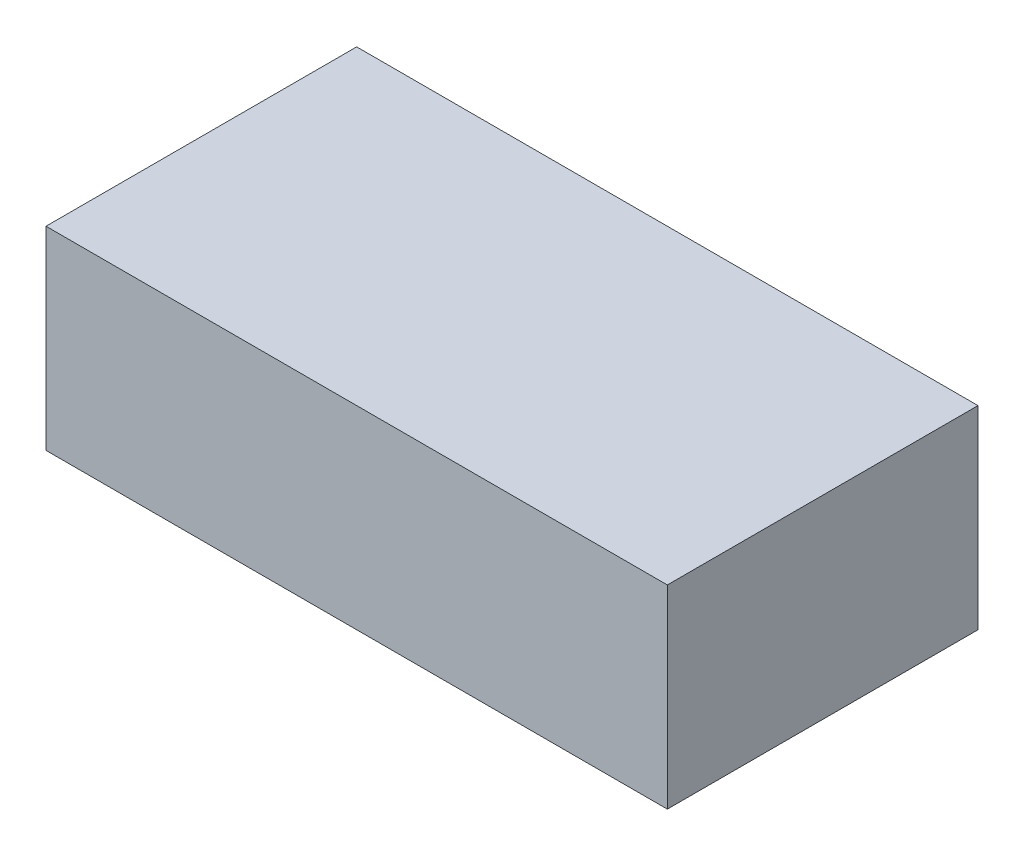
ISO-10303-21;
HEADER;
FILE_DESCRIPTION(('STEP AP214'),'2;1');
FILE_NAME('part.step','',(''),(''),'','','');
FILE_SCHEMA(('AUTOMOTIVE_DESIGN { 1 0 10303 214 1 1 1 1 }'));
ENDSEC;
DATA;
#1=APPLICATION_CONTEXT('core data for automotive mechanical design processes');
#2=APPLICATION_PROTOCOL_DEFINITION('international standard','automotive_design',2000,#1);
#3=PRODUCT_CONTEXT('',#1,'mechanical');
#4=PRODUCT('Part','Part','',(#3));
#5=PRODUCT_RELATED_PRODUCT_CATEGORY('part','',(#4));
#6=PRODUCT_DEFINITION_FORMATION('','',#4);
#7=PRODUCT_DEFINITION_CONTEXT('part definition',#1,'design');
#8=PRODUCT_DEFINITION('design','',#6,#7);
#9=PRODUCT_DEFINITION_SHAPE('','',#8);
#10=(LENGTH_UNIT() NAMED_UNIT(*) SI_UNIT(.MILLI.,.METRE.));
#11=(NAMED_UNIT(*) PLANE_ANGLE_UNIT() SI_UNIT($,.RADIAN.));
#12=(NAMED_UNIT(*) SI_UNIT($,.STERADIAN.) SOLID_ANGLE_UNIT());
#13=UNCERTAINTY_MEASURE_WITH_UNIT(LENGTH_MEASURE(1.E-05),#10,'distance_accuracy_value','');
#14=(GEOMETRIC_REPRESENTATION_CONTEXT(3) GLOBAL_UNCERTAINTY_ASSIGNED_CONTEXT((#13)) GLOBAL_UNIT_ASSIGNED_CONTEXT((#10,
#11,#12)) REPRESENTATION_CONTEXT('',''));
#15=CARTESIAN_POINT('',(0.,0.,0.));
#16=DIRECTION('',(0.,0.,1.));
#17=DIRECTION('',(1.,0.,0.));
#18=AXIS2_PLACEMENT_3D('',#15,#16,#17);
#19=CARTESIAN_POINT('',(200.,125.,100.));
#20=DIRECTION('',(-1.,0.,0.));
#21=DIRECTION('',(0.,0.,1.));
#22=AXIS2_PLACEMENT_3D('',#19,#20,#21);
#23=PLANE('',#22);
#24=DIRECTION('',(0.,0.,-1.));
#25=VECTOR('',#24,1.);
#26=CARTESIAN_POINT('',(200.,0.,100.));
#27=LINE('',#26,#25);
#28=CARTESIAN_POINT('',(200.,0.,100.));
#29=VERTEX_POINT('',#28);
#30=CARTESIAN_POINT('',(200.,0.,-100.));
#31=VERTEX_POINT('',#30);
#32=EDGE_CURVE('E96',#29,#31,#27,.T.);
#33=ORIENTED_EDGE('',*,*,#32,.T.);
#34=DIRECTION('',(0.,-1.,0.));
#35=VECTOR('',#34,1.);
#36=CARTESIAN_POINT('',(200.,125.,-100.));
#37=LINE('',#36,#35);
#38=CARTESIAN_POINT('',(200.,125.,-100.));
#39=VERTEX_POINT('',#38);
#40=EDGE_CURVE('E11',#39,#31,#37,.T.);
#41=ORIENTED_EDGE('',*,*,#40,.F.);
#42=DIRECTION('',(0.,0.,-1.));
#43=VECTOR('',#42,1.);
#44=CARTESIAN_POINT('',(200.,125.,100.));
#45=LINE('',#44,#43);
#46=CARTESIAN_POINT('',(200.,125.,100.));
#47=VERTEX_POINT('',#46);
#48=EDGE_CURVE('E84',#47,#39,#45,.T.);
#49=ORIENTED_EDGE('',*,*,#48,.F.);
#50=DIRECTION('',(0.,-1.,0.));
#51=VECTOR('',#50,1.);
#52=CARTESIAN_POINT('',(200.,125.,100.));
#53=LINE('',#52,#51);
#54=EDGE_CURVE('E92',#47,#29,#53,.T.);
#55=ORIENTED_EDGE('',*,*,#54,.T.);
#56=EDGE_LOOP('',(#33,#41,#49,#55));
#57=FACE_BOUND('',#56,.T.);
#58=ADVANCED_FACE('F33',(#57),#23,.F.);
#59=CARTESIAN_POINT('',(-200.,125.,-100.));
#60=DIRECTION('',(0.,0.,1.));
#61=DIRECTION('',(1.,0.,0.));
#62=AXIS2_PLACEMENT_3D('',#59,#60,#61);
#63=PLANE('',#62);
#64=DIRECTION('',(-1.,0.,0.));
#65=VECTOR('',#64,1.);
#66=CARTESIAN_POINT('',(-200.,0.,-100.));
#67=LINE('',#66,#65);
#68=CARTESIAN_POINT('',(-200.,0.,-100.));
#69=VERTEX_POINT('',#68);
#70=EDGE_CURVE('E88',#31,#69,#67,.T.);
#71=ORIENTED_EDGE('',*,*,#70,.T.);
#72=DIRECTION('',(0.,-1.,0.));
#73=VECTOR('',#72,1.);
#74=CARTESIAN_POINT('',(-200.,125.,-100.));
#75=LINE('',#74,#73);
#76=CARTESIAN_POINT('',(-200.,125.,-100.));
#77=VERTEX_POINT('',#76);
#78=EDGE_CURVE('E41',#77,#69,#75,.T.);
#79=ORIENTED_EDGE('',*,*,#78,.F.);
#80=DIRECTION('',(-1.,0.,0.));
#81=VECTOR('',#80,1.);
#82=CARTESIAN_POINT('',(-200.,125.,-100.));
#83=LINE('',#82,#81);
#84=EDGE_CURVE('E79',#39,#77,#83,.T.);
#85=ORIENTED_EDGE('',*,*,#84,.F.);
#86=ORIENTED_EDGE('',*,*,#40,.T.);
#87=EDGE_LOOP('',(#71,#79,#85,#86));
#88=FACE_BOUND('',#87,.T.);
#89=ADVANCED_FACE('F87',(#88),#63,.F.);
#90=CARTESIAN_POINT('',(-200.,125.,100.));
#91=DIRECTION('',(1.,0.,0.));
#92=DIRECTION('',(0.,0.,-1.));
#93=AXIS2_PLACEMENT_3D('',#90,#91,#92);
#94=PLANE('',#93);
#95=DIRECTION('',(0.,0.,1.));
#96=VECTOR('',#95,1.);
#97=CARTESIAN_POINT('',(-200.,0.,100.));
#98=LINE('',#97,#96);
#99=CARTESIAN_POINT('',(-200.,0.,100.));
#100=VERTEX_POINT('',#99);
#101=EDGE_CURVE('E66',#69,#100,#98,.T.);
#102=ORIENTED_EDGE('',*,*,#101,.T.);
#103=DIRECTION('',(0.,-1.,0.));
#104=VECTOR('',#103,1.);
#105=CARTESIAN_POINT('',(-200.,125.,100.));
#106=LINE('',#105,#104);
#107=CARTESIAN_POINT('',(-200.,125.,100.));
#108=VERTEX_POINT('',#107);
#109=EDGE_CURVE('E89',#108,#100,#106,.T.);
#110=ORIENTED_EDGE('',*,*,#109,.F.);
#111=DIRECTION('',(0.,0.,1.));
#112=VECTOR('',#111,1.);
#113=CARTESIAN_POINT('',(-200.,125.,100.));
#114=LINE('',#113,#112);
#115=EDGE_CURVE('E82',#77,#108,#114,.T.);
#116=ORIENTED_EDGE('',*,*,#115,.F.);
#117=ORIENTED_EDGE('',*,*,#78,.T.);
#118=EDGE_LOOP('',(#102,#110,#116,#117));
#119=FACE_BOUND('',#118,.T.);
#120=ADVANCED_FACE('F90',(#119),#94,.F.);
#121=CARTESIAN_POINT('',(-200.,125.,100.));
#122=DIRECTION('',(0.,0.,-1.));
#123=DIRECTION('',(-1.,0.,0.));
#124=AXIS2_PLACEMENT_3D('',#121,#122,#123);
#125=PLANE('',#124);
#126=DIRECTION('',(1.,0.,0.));
#127=VECTOR('',#126,1.);
#128=CARTESIAN_POINT('',(-200.,0.,100.));
#129=LINE('',#128,#127);
#130=EDGE_CURVE('E72',#100,#29,#129,.T.);
#131=ORIENTED_EDGE('',*,*,#130,.T.);
#132=ORIENTED_EDGE('',*,*,#54,.F.);
#133=DIRECTION('',(1.,0.,0.));
#134=VECTOR('',#133,1.);
#135=CARTESIAN_POINT('',(-200.,125.,100.));
#136=LINE('',#135,#134);
#137=EDGE_CURVE('E49',#108,#47,#136,.T.);
#138=ORIENTED_EDGE('',*,*,#137,.F.);
#139=ORIENTED_EDGE('',*,*,#109,.T.);
#140=EDGE_LOOP('',(#131,#132,#138,#139));
#141=FACE_BOUND('',#140,.T.);
#142=ADVANCED_FACE('F103',(#141),#125,.F.);
#143=CARTESIAN_POINT('',(0.,125.,0.));
#144=DIRECTION('',(0.,-1.,0.));
#145=DIRECTION('',(0.,0.,-1.));
#146=AXIS2_PLACEMENT_3D('',#143,#144,#145);
#147=PLANE('',#146);
#148=ORIENTED_EDGE('',*,*,#48,.T.);
#149=ORIENTED_EDGE('',*,*,#84,.T.);
#150=ORIENTED_EDGE('',*,*,#115,.T.);
#151=ORIENTED_EDGE('',*,*,#137,.T.);
#152=EDGE_LOOP('',(#148,#149,#150,#151));
#153=FACE_BOUND('',#152,.T.);
#154=ADVANCED_FACE('F80',(#153),#147,.F.);
#155=CARTESIAN_POINT('',(0.,0.,0.));
#156=DIRECTION('',(0.,-1.,0.));
#157=DIRECTION('',(0.,0.,-1.));
#158=AXIS2_PLACEMENT_3D('',#155,#156,#157);
#159=PLANE('',#158);
#160=ORIENTED_EDGE('',*,*,#32,.F.);
#161=ORIENTED_EDGE('',*,*,#130,.F.);
#162=ORIENTED_EDGE('',*,*,#101,.F.);
#163=ORIENTED_EDGE('',*,*,#70,.F.);
#164=EDGE_LOOP('',(#160,#161,#162,#163));
#165=FACE_BOUND('',#164,.T.);
#166=ADVANCED_FACE('F106',(#165),#159,.T.);
#167=CLOSED_SHELL('',(#58,#89,#120,#142,#154,#166));
#168=MANIFOLD_SOLID_BREP('B2',#167);
#169=ADVANCED_BREP_SHAPE_REPRESENTATION('',(#18,#168),#14);
#170=SHAPE_DEFINITION_REPRESENTATION(#9,#169);
ENDSEC;
END-ISO-10303-21;
